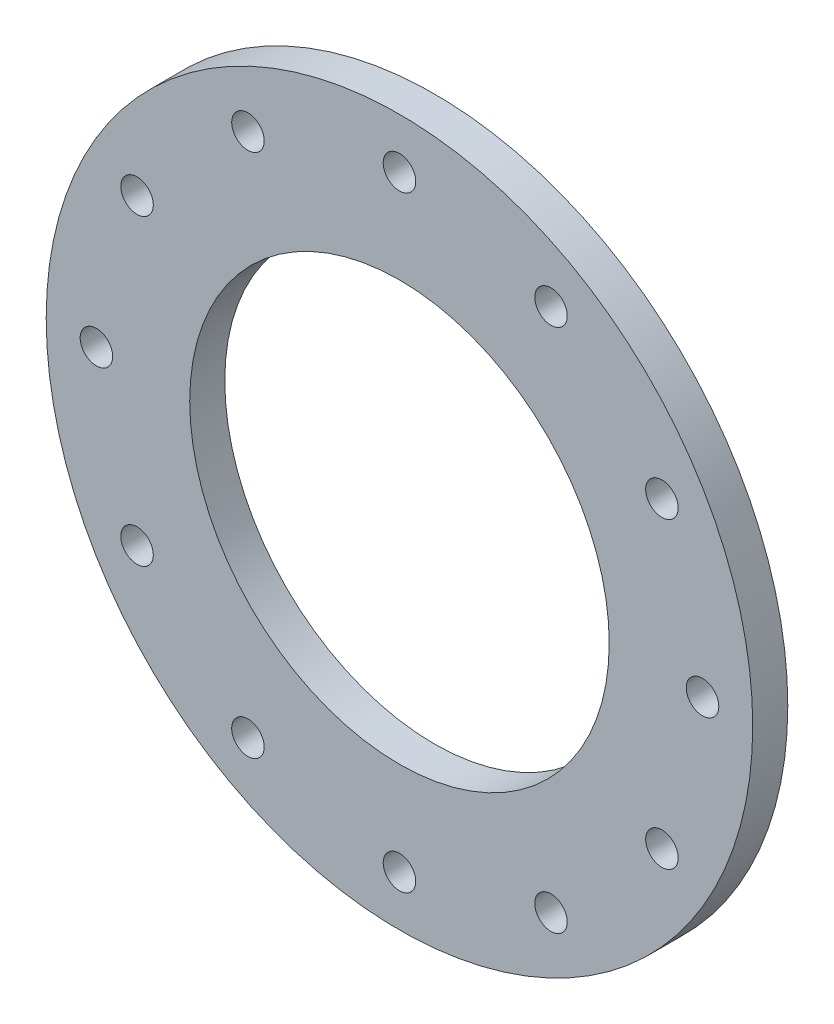
ISO-10303-21;
HEADER;
FILE_DESCRIPTION(('STEP AP214'),'2;1');
FILE_NAME('part.step','',(''),(''),'','','');
FILE_SCHEMA(('AUTOMOTIVE_DESIGN { 1 0 10303 214 1 1 1 1 }'));
ENDSEC;
DATA;
#1=APPLICATION_CONTEXT('core data for automotive mechanical design processes');
#2=APPLICATION_PROTOCOL_DEFINITION('international standard','automotive_design',2000,#1);
#3=PRODUCT_CONTEXT('',#1,'mechanical');
#4=PRODUCT('Part','Part','',(#3));
#5=PRODUCT_RELATED_PRODUCT_CATEGORY('part','',(#4));
#6=PRODUCT_DEFINITION_FORMATION('','',#4);
#7=PRODUCT_DEFINITION_CONTEXT('part definition',#1,'design');
#8=PRODUCT_DEFINITION('design','',#6,#7);
#9=PRODUCT_DEFINITION_SHAPE('','',#8);
#10=(LENGTH_UNIT() NAMED_UNIT(*) SI_UNIT(.MILLI.,.METRE.));
#11=(NAMED_UNIT(*) PLANE_ANGLE_UNIT() SI_UNIT($,.RADIAN.));
#12=(NAMED_UNIT(*) SI_UNIT($,.STERADIAN.) SOLID_ANGLE_UNIT());
#13=UNCERTAINTY_MEASURE_WITH_UNIT(LENGTH_MEASURE(1.E-05),#10,'distance_accuracy_value','');
#14=(GEOMETRIC_REPRESENTATION_CONTEXT(3) GLOBAL_UNCERTAINTY_ASSIGNED_CONTEXT((#13)) GLOBAL_UNIT_ASSIGNED_CONTEXT((#10,
#11,#12)) REPRESENTATION_CONTEXT('',''));
#15=CARTESIAN_POINT('',(0.,0.,0.));
#16=DIRECTION('',(0.,0.,1.));
#17=DIRECTION('',(1.,0.,0.));
#18=AXIS2_PLACEMENT_3D('',#15,#16,#17);
#19=CARTESIAN_POINT('',(-17.5,-28.25,3.37499999999996));
#20=DIRECTION('',(0.,0.,1.));
#21=DIRECTION('',(1.,0.,0.));
#22=AXIS2_PLACEMENT_3D('',#19,#20,#21);
#23=PLANE('',#22);
#24=CARTESIAN_POINT('',(6.27239733388261,-41.9750000000003,3.37499999999996));
#25=DIRECTION('',(0.,0.,1.));
#26=DIRECTION('',(1.,0.,0.));
#27=AXIS2_PLACEMENT_3D('',#24,#25,#26);
#28=CIRCLE('',#27,1.4732);
#29=CARTESIAN_POINT('',(7.74559733388261,-41.9750000000003,3.37499999999996));
#30=VERTEX_POINT('',#29);
#31=EDGE_CURVE('E127',#30,#30,#28,.T.);
#32=ORIENTED_EDGE('',*,*,#31,.F.);
#33=EDGE_LOOP('',(#32));
#34=FACE_BOUND('',#33,.T.);
#35=CARTESIAN_POINT('',(6.27239733388291,-14.5250000000002,3.37499999999996));
#36=DIRECTION('',(0.,0.,1.));
#37=DIRECTION('',(1.,0.,0.));
#38=AXIS2_PLACEMENT_3D('',#35,#36,#37);
#39=CIRCLE('',#38,1.4732);
#40=CARTESIAN_POINT('',(7.74559733388291,-14.5250000000002,3.37499999999996));
#41=VERTEX_POINT('',#40);
#42=EDGE_CURVE('E112',#41,#41,#39,.T.);
#43=ORIENTED_EDGE('',*,*,#42,.F.);
#44=EDGE_LOOP('',(#43));
#45=FACE_BOUND('',#44,.T.);
#46=CARTESIAN_POINT('',(-17.4999999999999,-0.800000000000016,3.37499999999996));
#47=DIRECTION('',(0.,0.,1.));
#48=DIRECTION('',(1.,0.,0.));
#49=AXIS2_PLACEMENT_3D('',#46,#47,#48);
#50=CIRCLE('',#49,1.4732);
#51=CARTESIAN_POINT('',(-16.0267999999999,-0.800000000000016,3.37499999999996));
#52=VERTEX_POINT('',#51);
#53=EDGE_CURVE('E105',#52,#52,#50,.T.);
#54=ORIENTED_EDGE('',*,*,#53,.F.);
#55=EDGE_LOOP('',(#54));
#56=FACE_BOUND('',#55,.T.);
#57=CARTESIAN_POINT('',(-41.2723973338828,-14.5249999999999,3.37499999999996));
#58=DIRECTION('',(0.,0.,1.));
#59=DIRECTION('',(1.,0.,0.));
#60=AXIS2_PLACEMENT_3D('',#57,#58,#59);
#61=CIRCLE('',#60,1.4732);
#62=CARTESIAN_POINT('',(-39.7991973338828,-14.5249999999999,3.37499999999996));
#63=VERTEX_POINT('',#62);
#64=EDGE_CURVE('E85',#63,#63,#61,.T.);
#65=ORIENTED_EDGE('',*,*,#64,.F.);
#66=EDGE_LOOP('',(#65));
#67=FACE_BOUND('',#66,.T.);
#68=CARTESIAN_POINT('',(-41.2723973338829,-41.975,3.37499999999996));
#69=DIRECTION('',(0.,0.,1.));
#70=DIRECTION('',(1.,0.,0.));
#71=AXIS2_PLACEMENT_3D('',#68,#69,#70);
#72=CIRCLE('',#71,1.4732);
#73=CARTESIAN_POINT('',(-39.7991973338829,-41.975,3.37499999999996));
#74=VERTEX_POINT('',#73);
#75=EDGE_CURVE('E67',#74,#74,#72,.T.);
#76=ORIENTED_EDGE('',*,*,#75,.F.);
#77=EDGE_LOOP('',(#76));
#78=FACE_BOUND('',#77,.T.);
#79=CARTESIAN_POINT('',(-17.5,-55.7,3.37499999999996));
#80=DIRECTION('',(0.,0.,1.));
#81=DIRECTION('',(1.,0.,0.));
#82=AXIS2_PLACEMENT_3D('',#79,#80,#81);
#83=CIRCLE('',#82,1.4732);
#84=CARTESIAN_POINT('',(-16.0268,-55.7,3.37499999999996));
#85=VERTEX_POINT('',#84);
#86=EDGE_CURVE('E60',#85,#85,#83,.T.);
#87=ORIENTED_EDGE('',*,*,#86,.F.);
#88=EDGE_LOOP('',(#87));
#89=FACE_BOUND('',#88,.T.);
#90=CARTESIAN_POINT('',(-17.5,-28.25,3.37499999999996));
#91=DIRECTION('',(0.,0.,1.));
#92=DIRECTION('',(1.,0.,0.));
#93=AXIS2_PLACEMENT_3D('',#90,#91,#92);
#94=CIRCLE('',#93,32.);
#95=CARTESIAN_POINT('',(14.5,-28.25,3.37499999999996));
#96=VERTEX_POINT('',#95);
#97=EDGE_CURVE('E11',#96,#96,#94,.T.);
#98=ORIENTED_EDGE('',*,*,#97,.T.);
#99=EDGE_LOOP('',(#98));
#100=FACE_BOUND('',#99,.T.);
#101=CARTESIAN_POINT('',(-17.5,-28.25,3.37499999999996));
#102=DIRECTION('',(0.,0.,1.));
#103=DIRECTION('',(1.,0.,0.));
#104=AXIS2_PLACEMENT_3D('',#101,#102,#103);
#105=CIRCLE('',#104,19.);
#106=CARTESIAN_POINT('',(1.49999999999995,-28.25,3.37499999999996));
#107=VERTEX_POINT('',#106);
#108=EDGE_CURVE('E42',#107,#107,#105,.T.);
#109=ORIENTED_EDGE('',*,*,#108,.F.);
#110=EDGE_LOOP('',(#109));
#111=FACE_BOUND('',#110,.T.);
#112=CARTESIAN_POINT('',(-31.2250000000001,-52.0223973338828,3.37499999999996));
#113=DIRECTION('',(0.,0.,1.));
#114=DIRECTION('',(1.,0.,0.));
#115=AXIS2_PLACEMENT_3D('',#112,#113,#114);
#116=CIRCLE('',#115,1.4732);
#117=CARTESIAN_POINT('',(-29.7518000000001,-52.0223973338828,3.37499999999996));
#118=VERTEX_POINT('',#117);
#119=EDGE_CURVE('E61',#118,#118,#116,.T.);
#120=ORIENTED_EDGE('',*,*,#119,.F.);
#121=EDGE_LOOP('',(#120));
#122=FACE_BOUND('',#121,.T.);
#123=CARTESIAN_POINT('',(-44.95,-28.2499999999999,3.37499999999996));
#124=DIRECTION('',(0.,0.,1.));
#125=DIRECTION('',(1.,0.,0.));
#126=AXIS2_PLACEMENT_3D('',#123,#124,#125);
#127=CIRCLE('',#126,1.4732);
#128=CARTESIAN_POINT('',(-43.4768,-28.2499999999999,3.37499999999996));
#129=VERTEX_POINT('',#128);
#130=EDGE_CURVE('E74',#129,#129,#127,.T.);
#131=ORIENTED_EDGE('',*,*,#130,.F.);
#132=EDGE_LOOP('',(#131));
#133=FACE_BOUND('',#132,.T.);
#134=CARTESIAN_POINT('',(-31.2249999999999,-4.47760266611708,3.37499999999996));
#135=DIRECTION('',(0.,0.,1.));
#136=DIRECTION('',(1.,0.,0.));
#137=AXIS2_PLACEMENT_3D('',#134,#135,#136);
#138=CIRCLE('',#137,1.4732);
#139=CARTESIAN_POINT('',(-29.7517999999999,-4.47760266611708,3.37499999999996));
#140=VERTEX_POINT('',#139);
#141=EDGE_CURVE('E94',#140,#140,#138,.T.);
#142=ORIENTED_EDGE('',*,*,#141,.F.);
#143=EDGE_LOOP('',(#142));
#144=FACE_BOUND('',#143,.T.);
#145=CARTESIAN_POINT('',(-3.77499999999985,-4.47760266611728,3.37499999999996));
#146=DIRECTION('',(0.,0.,1.));
#147=DIRECTION('',(1.,0.,0.));
#148=AXIS2_PLACEMENT_3D('',#145,#146,#147);
#149=CIRCLE('',#148,1.4732);
#150=CARTESIAN_POINT('',(-2.30179999999986,-4.47760266611728,3.37499999999996));
#151=VERTEX_POINT('',#150);
#152=EDGE_CURVE('E106',#151,#151,#149,.T.);
#153=ORIENTED_EDGE('',*,*,#152,.F.);
#154=EDGE_LOOP('',(#153));
#155=FACE_BOUND('',#154,.T.);
#156=CARTESIAN_POINT('',(9.94999999999995,-28.2500000000003,3.37499999999996));
#157=DIRECTION('',(0.,0.,1.));
#158=DIRECTION('',(1.,0.,0.));
#159=AXIS2_PLACEMENT_3D('',#156,#157,#158);
#160=CIRCLE('',#159,1.4732);
#161=CARTESIAN_POINT('',(11.4232,-28.2500000000003,3.37499999999996));
#162=VERTEX_POINT('',#161);
#163=EDGE_CURVE('E119',#162,#162,#160,.T.);
#164=ORIENTED_EDGE('',*,*,#163,.F.);
#165=EDGE_LOOP('',(#164));
#166=FACE_BOUND('',#165,.T.);
#167=CARTESIAN_POINT('',(-3.77500000000035,-52.022397333883,3.37499999999996));
#168=DIRECTION('',(0.,0.,1.));
#169=DIRECTION('',(1.,0.,0.));
#170=AXIS2_PLACEMENT_3D('',#167,#168,#169);
#171=CIRCLE('',#170,1.4732);
#172=CARTESIAN_POINT('',(-2.30180000000035,-52.022397333883,3.37499999999996));
#173=VERTEX_POINT('',#172);
#174=EDGE_CURVE('E135',#173,#173,#171,.T.);
#175=ORIENTED_EDGE('',*,*,#174,.F.);
#176=EDGE_LOOP('',(#175));
#177=FACE_BOUND('',#176,.T.);
#178=ADVANCED_FACE('F31',(#34,#45,#56,#67,#78,#89,#100,#111,#122,#133,#144,#155,#166,#177),#23,.T.);
#179=CARTESIAN_POINT('',(-17.5,-28.25,0.199999999999961));
#180=DIRECTION('',(0.,0.,1.));
#181=DIRECTION('',(1.,0.,0.));
#182=AXIS2_PLACEMENT_3D('',#179,#180,#181);
#183=PLANE('',#182);
#184=CARTESIAN_POINT('',(-17.5,-28.25,0.199999999999961));
#185=DIRECTION('',(0.,0.,1.));
#186=DIRECTION('',(1.,0.,0.));
#187=AXIS2_PLACEMENT_3D('',#184,#185,#186);
#188=CIRCLE('',#187,32.);
#189=CARTESIAN_POINT('',(14.5,-28.25,0.199999999999961));
#190=VERTEX_POINT('',#189);
#191=EDGE_CURVE('E35',#190,#190,#188,.T.);
#192=ORIENTED_EDGE('',*,*,#191,.F.);
#193=EDGE_LOOP('',(#192));
#194=FACE_BOUND('',#193,.T.);
#195=CARTESIAN_POINT('',(-17.5,-28.25,0.199999999999961));
#196=DIRECTION('',(0.,0.,1.));
#197=DIRECTION('',(1.,0.,0.));
#198=AXIS2_PLACEMENT_3D('',#195,#196,#197);
#199=CIRCLE('',#198,19.);
#200=CARTESIAN_POINT('',(1.49999999999995,-28.25,0.199999999999961));
#201=VERTEX_POINT('',#200);
#202=EDGE_CURVE('E45',#201,#201,#199,.T.);
#203=ORIENTED_EDGE('',*,*,#202,.T.);
#204=EDGE_LOOP('',(#203));
#205=FACE_BOUND('',#204,.T.);
#206=CARTESIAN_POINT('',(-17.5,-55.7,0.199999999999961));
#207=DIRECTION('',(0.,0.,1.));
#208=DIRECTION('',(1.,0.,0.));
#209=AXIS2_PLACEMENT_3D('',#206,#207,#208);
#210=CIRCLE('',#209,1.4732);
#211=CARTESIAN_POINT('',(-16.0268,-55.7,0.199999999999961));
#212=VERTEX_POINT('',#211);
#213=EDGE_CURVE('E58',#212,#212,#210,.T.);
#214=ORIENTED_EDGE('',*,*,#213,.T.);
#215=EDGE_LOOP('',(#214));
#216=FACE_BOUND('',#215,.T.);
#217=CARTESIAN_POINT('',(-31.2250000000001,-52.0223973338828,0.199999999999961));
#218=DIRECTION('',(0.,0.,1.));
#219=DIRECTION('',(1.,0.,0.));
#220=AXIS2_PLACEMENT_3D('',#217,#218,#219);
#221=CIRCLE('',#220,1.4732);
#222=CARTESIAN_POINT('',(-29.7518000000001,-52.0223973338828,0.199999999999961));
#223=VERTEX_POINT('',#222);
#224=EDGE_CURVE('E65',#223,#223,#221,.T.);
#225=ORIENTED_EDGE('',*,*,#224,.T.);
#226=EDGE_LOOP('',(#225));
#227=FACE_BOUND('',#226,.T.);
#228=CARTESIAN_POINT('',(-41.2723973338829,-41.975,0.199999999999961));
#229=DIRECTION('',(0.,0.,1.));
#230=DIRECTION('',(1.,0.,0.));
#231=AXIS2_PLACEMENT_3D('',#228,#229,#230);
#232=CIRCLE('',#231,1.4732);
#233=CARTESIAN_POINT('',(-39.7991973338829,-41.975,0.199999999999961));
#234=VERTEX_POINT('',#233);
#235=EDGE_CURVE('E71',#234,#234,#232,.T.);
#236=ORIENTED_EDGE('',*,*,#235,.T.);
#237=EDGE_LOOP('',(#236));
#238=FACE_BOUND('',#237,.T.);
#239=CARTESIAN_POINT('',(-44.95,-28.2499999999999,0.199999999999961));
#240=DIRECTION('',(0.,0.,1.));
#241=DIRECTION('',(1.,0.,0.));
#242=AXIS2_PLACEMENT_3D('',#239,#240,#241);
#243=CIRCLE('',#242,1.4732);
#244=CARTESIAN_POINT('',(-43.4768,-28.2499999999999,0.199999999999961));
#245=VERTEX_POINT('',#244);
#246=EDGE_CURVE('E78',#245,#245,#243,.T.);
#247=ORIENTED_EDGE('',*,*,#246,.T.);
#248=EDGE_LOOP('',(#247));
#249=FACE_BOUND('',#248,.T.);
#250=CARTESIAN_POINT('',(-41.2723973338828,-14.5249999999999,0.199999999999961));
#251=DIRECTION('',(0.,0.,1.));
#252=DIRECTION('',(1.,0.,0.));
#253=AXIS2_PLACEMENT_3D('',#250,#251,#252);
#254=CIRCLE('',#253,1.4732);
#255=CARTESIAN_POINT('',(-39.7991973338828,-14.5249999999999,0.199999999999961));
#256=VERTEX_POINT('',#255);
#257=EDGE_CURVE('E90',#256,#256,#254,.T.);
#258=ORIENTED_EDGE('',*,*,#257,.T.);
#259=EDGE_LOOP('',(#258));
#260=FACE_BOUND('',#259,.T.);
#261=CARTESIAN_POINT('',(-31.2249999999999,-4.47760266611708,0.199999999999961));
#262=DIRECTION('',(0.,0.,1.));
#263=DIRECTION('',(1.,0.,0.));
#264=AXIS2_PLACEMENT_3D('',#261,#262,#263);
#265=CIRCLE('',#264,1.4732);
#266=CARTESIAN_POINT('',(-29.7517999999999,-4.47760266611708,0.199999999999961));
#267=VERTEX_POINT('',#266);
#268=EDGE_CURVE('E91',#267,#267,#265,.T.);
#269=ORIENTED_EDGE('',*,*,#268,.T.);
#270=EDGE_LOOP('',(#269));
#271=FACE_BOUND('',#270,.T.);
#272=CARTESIAN_POINT('',(-17.4999999999999,-0.800000000000016,0.199999999999961));
#273=DIRECTION('',(0.,0.,1.));
#274=DIRECTION('',(1.,0.,0.));
#275=AXIS2_PLACEMENT_3D('',#272,#273,#274);
#276=CIRCLE('',#275,1.4732);
#277=CARTESIAN_POINT('',(-16.0267999999999,-0.800000000000016,0.199999999999961));
#278=VERTEX_POINT('',#277);
#279=EDGE_CURVE('E103',#278,#278,#276,.T.);
#280=ORIENTED_EDGE('',*,*,#279,.T.);
#281=EDGE_LOOP('',(#280));
#282=FACE_BOUND('',#281,.T.);
#283=CARTESIAN_POINT('',(-3.77499999999985,-4.47760266611728,0.199999999999961));
#284=DIRECTION('',(0.,0.,1.));
#285=DIRECTION('',(1.,0.,0.));
#286=AXIS2_PLACEMENT_3D('',#283,#284,#285);
#287=CIRCLE('',#286,1.4732);
#288=CARTESIAN_POINT('',(-2.30179999999986,-4.47760266611728,0.199999999999961));
#289=VERTEX_POINT('',#288);
#290=EDGE_CURVE('E110',#289,#289,#287,.T.);
#291=ORIENTED_EDGE('',*,*,#290,.T.);
#292=EDGE_LOOP('',(#291));
#293=FACE_BOUND('',#292,.T.);
#294=CARTESIAN_POINT('',(6.27239733388291,-14.5250000000002,0.199999999999961));
#295=DIRECTION('',(0.,0.,1.));
#296=DIRECTION('',(1.,0.,0.));
#297=AXIS2_PLACEMENT_3D('',#294,#295,#296);
#298=CIRCLE('',#297,1.4732);
#299=CARTESIAN_POINT('',(7.74559733388291,-14.5250000000002,0.199999999999961));
#300=VERTEX_POINT('',#299);
#301=EDGE_CURVE('E116',#300,#300,#298,.T.);
#302=ORIENTED_EDGE('',*,*,#301,.T.);
#303=EDGE_LOOP('',(#302));
#304=FACE_BOUND('',#303,.T.);
#305=CARTESIAN_POINT('',(9.94999999999995,-28.2500000000003,0.199999999999961));
#306=DIRECTION('',(0.,0.,1.));
#307=DIRECTION('',(1.,0.,0.));
#308=AXIS2_PLACEMENT_3D('',#305,#306,#307);
#309=CIRCLE('',#308,1.4732);
#310=CARTESIAN_POINT('',(11.4232,-28.2500000000003,0.199999999999961));
#311=VERTEX_POINT('',#310);
#312=EDGE_CURVE('E123',#311,#311,#309,.T.);
#313=ORIENTED_EDGE('',*,*,#312,.T.);
#314=EDGE_LOOP('',(#313));
#315=FACE_BOUND('',#314,.T.);
#316=CARTESIAN_POINT('',(6.27239733388261,-41.9750000000003,0.199999999999961));
#317=DIRECTION('',(0.,0.,1.));
#318=DIRECTION('',(1.,0.,0.));
#319=AXIS2_PLACEMENT_3D('',#316,#317,#318);
#320=CIRCLE('',#319,1.4732);
#321=CARTESIAN_POINT('',(7.74559733388261,-41.9750000000003,0.199999999999961));
#322=VERTEX_POINT('',#321);
#323=EDGE_CURVE('E132',#322,#322,#320,.T.);
#324=ORIENTED_EDGE('',*,*,#323,.T.);
#325=EDGE_LOOP('',(#324));
#326=FACE_BOUND('',#325,.T.);
#327=CARTESIAN_POINT('',(-3.77500000000035,-52.022397333883,0.199999999999961));
#328=DIRECTION('',(0.,0.,1.));
#329=DIRECTION('',(1.,0.,0.));
#330=AXIS2_PLACEMENT_3D('',#327,#328,#329);
#331=CIRCLE('',#330,1.4732);
#332=CARTESIAN_POINT('',(-2.30180000000035,-52.022397333883,0.199999999999961));
#333=VERTEX_POINT('',#332);
#334=EDGE_CURVE('E133',#333,#333,#331,.T.);
#335=ORIENTED_EDGE('',*,*,#334,.T.);
#336=EDGE_LOOP('',(#335));
#337=FACE_BOUND('',#336,.T.);
#338=ADVANCED_FACE('F143',(#194,#205,#216,#227,#238,#249,#260,#271,#282,#293,#304,#315,#326,
#337),#183,.F.);
#339=CARTESIAN_POINT('',(-17.5,-28.25,3.37499999999996));
#340=DIRECTION('',(0.,0.,-1.));
#341=DIRECTION('',(-1.,0.,0.));
#342=AXIS2_PLACEMENT_3D('',#339,#340,#341);
#343=CYLINDRICAL_SURFACE('',#342,32.);
#344=ORIENTED_EDGE('',*,*,#97,.F.);
#345=EDGE_LOOP('',(#344));
#346=FACE_BOUND('',#345,.T.);
#347=ORIENTED_EDGE('',*,*,#191,.T.);
#348=EDGE_LOOP('',(#347));
#349=FACE_BOUND('',#348,.T.);
#350=ADVANCED_FACE('F33',(#346,#349),#343,.T.);
#351=CARTESIAN_POINT('',(-17.5,-28.25,3.37499999999996));
#352=DIRECTION('',(0.,0.,-1.));
#353=DIRECTION('',(-1.,0.,0.));
#354=AXIS2_PLACEMENT_3D('',#351,#352,#353);
#355=CYLINDRICAL_SURFACE('',#354,19.);
#356=ORIENTED_EDGE('',*,*,#108,.T.);
#357=EDGE_LOOP('',(#356));
#358=FACE_BOUND('',#357,.T.);
#359=ORIENTED_EDGE('',*,*,#202,.F.);
#360=EDGE_LOOP('',(#359));
#361=FACE_BOUND('',#360,.T.);
#362=ADVANCED_FACE('F171',(#358,#361),#355,.F.);
#363=CARTESIAN_POINT('',(-17.5,-55.7,3.37499999999996));
#364=DIRECTION('',(0.,0.,-1.));
#365=DIRECTION('',(-1.,0.,0.));
#366=AXIS2_PLACEMENT_3D('',#363,#364,#365);
#367=CYLINDRICAL_SURFACE('',#366,1.4732);
#368=ORIENTED_EDGE('',*,*,#86,.T.);
#369=EDGE_LOOP('',(#368));
#370=FACE_BOUND('',#369,.T.);
#371=ORIENTED_EDGE('',*,*,#213,.F.);
#372=EDGE_LOOP('',(#371));
#373=FACE_BOUND('',#372,.T.);
#374=ADVANCED_FACE('F174',(#370,#373),#367,.F.);
#375=CARTESIAN_POINT('',(-31.2250000000001,-52.0223973338828,3.37499999999996));
#376=DIRECTION('',(0.,0.,-1.));
#377=DIRECTION('',(-1.,0.,0.));
#378=AXIS2_PLACEMENT_3D('',#375,#376,#377);
#379=CYLINDRICAL_SURFACE('',#378,1.4732);
#380=ORIENTED_EDGE('',*,*,#119,.T.);
#381=EDGE_LOOP('',(#380));
#382=FACE_BOUND('',#381,.T.);
#383=ORIENTED_EDGE('',*,*,#224,.F.);
#384=EDGE_LOOP('',(#383));
#385=FACE_BOUND('',#384,.T.);
#386=ADVANCED_FACE('F178',(#382,#385),#379,.F.);
#387=CARTESIAN_POINT('',(-41.2723973338829,-41.975,3.37499999999996));
#388=DIRECTION('',(0.,0.,-1.));
#389=DIRECTION('',(-1.,0.,0.));
#390=AXIS2_PLACEMENT_3D('',#387,#388,#389);
#391=CYLINDRICAL_SURFACE('',#390,1.4732);
#392=ORIENTED_EDGE('',*,*,#75,.T.);
#393=EDGE_LOOP('',(#392));
#394=FACE_BOUND('',#393,.T.);
#395=ORIENTED_EDGE('',*,*,#235,.F.);
#396=EDGE_LOOP('',(#395));
#397=FACE_BOUND('',#396,.T.);
#398=ADVANCED_FACE('F182',(#394,#397),#391,.F.);
#399=CARTESIAN_POINT('',(-44.95,-28.2499999999999,3.37499999999996));
#400=DIRECTION('',(0.,0.,-1.));
#401=DIRECTION('',(-1.,0.,0.));
#402=AXIS2_PLACEMENT_3D('',#399,#400,#401);
#403=CYLINDRICAL_SURFACE('',#402,1.4732);
#404=ORIENTED_EDGE('',*,*,#130,.T.);
#405=EDGE_LOOP('',(#404));
#406=FACE_BOUND('',#405,.T.);
#407=ORIENTED_EDGE('',*,*,#246,.F.);
#408=EDGE_LOOP('',(#407));
#409=FACE_BOUND('',#408,.T.);
#410=ADVANCED_FACE('F186',(#406,#409),#403,.F.);
#411=CARTESIAN_POINT('',(-41.2723973338828,-14.5249999999999,3.37499999999996));
#412=DIRECTION('',(0.,0.,-1.));
#413=DIRECTION('',(-1.,0.,0.));
#414=AXIS2_PLACEMENT_3D('',#411,#412,#413);
#415=CYLINDRICAL_SURFACE('',#414,1.4732);
#416=ORIENTED_EDGE('',*,*,#64,.T.);
#417=EDGE_LOOP('',(#416));
#418=FACE_BOUND('',#417,.T.);
#419=ORIENTED_EDGE('',*,*,#257,.F.);
#420=EDGE_LOOP('',(#419));
#421=FACE_BOUND('',#420,.T.);
#422=ADVANCED_FACE('F190',(#418,#421),#415,.F.);
#423=CARTESIAN_POINT('',(-31.2249999999999,-4.47760266611708,3.37499999999996));
#424=DIRECTION('',(0.,0.,-1.));
#425=DIRECTION('',(-1.,0.,0.));
#426=AXIS2_PLACEMENT_3D('',#423,#424,#425);
#427=CYLINDRICAL_SURFACE('',#426,1.4732);
#428=ORIENTED_EDGE('',*,*,#141,.T.);
#429=EDGE_LOOP('',(#428));
#430=FACE_BOUND('',#429,.T.);
#431=ORIENTED_EDGE('',*,*,#268,.F.);
#432=EDGE_LOOP('',(#431));
#433=FACE_BOUND('',#432,.T.);
#434=ADVANCED_FACE('F194',(#430,#433),#427,.F.);
#435=CARTESIAN_POINT('',(-17.4999999999999,-0.800000000000016,3.37499999999996));
#436=DIRECTION('',(0.,0.,-1.));
#437=DIRECTION('',(-1.,0.,0.));
#438=AXIS2_PLACEMENT_3D('',#435,#436,#437);
#439=CYLINDRICAL_SURFACE('',#438,1.4732);
#440=ORIENTED_EDGE('',*,*,#53,.T.);
#441=EDGE_LOOP('',(#440));
#442=FACE_BOUND('',#441,.T.);
#443=ORIENTED_EDGE('',*,*,#279,.F.);
#444=EDGE_LOOP('',(#443));
#445=FACE_BOUND('',#444,.T.);
#446=ADVANCED_FACE('F198',(#442,#445),#439,.F.);
#447=CARTESIAN_POINT('',(-3.77499999999985,-4.47760266611728,3.37499999999996));
#448=DIRECTION('',(0.,0.,-1.));
#449=DIRECTION('',(-1.,0.,0.));
#450=AXIS2_PLACEMENT_3D('',#447,#448,#449);
#451=CYLINDRICAL_SURFACE('',#450,1.4732);
#452=ORIENTED_EDGE('',*,*,#152,.T.);
#453=EDGE_LOOP('',(#452));
#454=FACE_BOUND('',#453,.T.);
#455=ORIENTED_EDGE('',*,*,#290,.F.);
#456=EDGE_LOOP('',(#455));
#457=FACE_BOUND('',#456,.T.);
#458=ADVANCED_FACE('F158',(#454,#457),#451,.F.);
#459=CARTESIAN_POINT('',(6.27239733388291,-14.5250000000002,3.37499999999996));
#460=DIRECTION('',(0.,0.,-1.));
#461=DIRECTION('',(-1.,0.,0.));
#462=AXIS2_PLACEMENT_3D('',#459,#460,#461);
#463=CYLINDRICAL_SURFACE('',#462,1.4732);
#464=ORIENTED_EDGE('',*,*,#42,.T.);
#465=EDGE_LOOP('',(#464));
#466=FACE_BOUND('',#465,.T.);
#467=ORIENTED_EDGE('',*,*,#301,.F.);
#468=EDGE_LOOP('',(#467));
#469=FACE_BOUND('',#468,.T.);
#470=ADVANCED_FACE('F149',(#466,#469),#463,.F.);
#471=CARTESIAN_POINT('',(9.94999999999995,-28.2500000000003,3.37499999999996));
#472=DIRECTION('',(0.,0.,-1.));
#473=DIRECTION('',(-1.,0.,0.));
#474=AXIS2_PLACEMENT_3D('',#471,#472,#473);
#475=CYLINDRICAL_SURFACE('',#474,1.4732);
#476=ORIENTED_EDGE('',*,*,#163,.T.);
#477=EDGE_LOOP('',(#476));
#478=FACE_BOUND('',#477,.T.);
#479=ORIENTED_EDGE('',*,*,#312,.F.);
#480=EDGE_LOOP('',(#479));
#481=FACE_BOUND('',#480,.T.);
#482=ADVANCED_FACE('F146',(#478,#481),#475,.F.);
#483=CARTESIAN_POINT('',(6.27239733388261,-41.9750000000003,3.37499999999996));
#484=DIRECTION('',(0.,0.,-1.));
#485=DIRECTION('',(-1.,0.,0.));
#486=AXIS2_PLACEMENT_3D('',#483,#484,#485);
#487=CYLINDRICAL_SURFACE('',#486,1.4732);
#488=ORIENTED_EDGE('',*,*,#31,.T.);
#489=EDGE_LOOP('',(#488));
#490=FACE_BOUND('',#489,.T.);
#491=ORIENTED_EDGE('',*,*,#323,.F.);
#492=EDGE_LOOP('',(#491));
#493=FACE_BOUND('',#492,.T.);
#494=ADVANCED_FACE('F148',(#490,#493),#487,.F.);
#495=CARTESIAN_POINT('',(-3.77500000000035,-52.022397333883,3.37499999999996));
#496=DIRECTION('',(0.,0.,-1.));
#497=DIRECTION('',(-1.,0.,0.));
#498=AXIS2_PLACEMENT_3D('',#495,#496,#497);
#499=CYLINDRICAL_SURFACE('',#498,1.4732);
#500=ORIENTED_EDGE('',*,*,#174,.T.);
#501=EDGE_LOOP('',(#500));
#502=FACE_BOUND('',#501,.T.);
#503=ORIENTED_EDGE('',*,*,#334,.F.);
#504=EDGE_LOOP('',(#503));
#505=FACE_BOUND('',#504,.T.);
#506=ADVANCED_FACE('F155',(#502,#505),#499,.F.);
#507=CLOSED_SHELL('',(#178,#338,#350,#362,#374,#386,#398,#410,#422,#434,#446,#458,#470,#482,
#494,#506));
#508=MANIFOLD_SOLID_BREP('B2',#507);
#509=ADVANCED_BREP_SHAPE_REPRESENTATION('',(#18,#508),#14);
#510=SHAPE_DEFINITION_REPRESENTATION(#9,#509);
ENDSEC;
END-ISO-10303-21;
